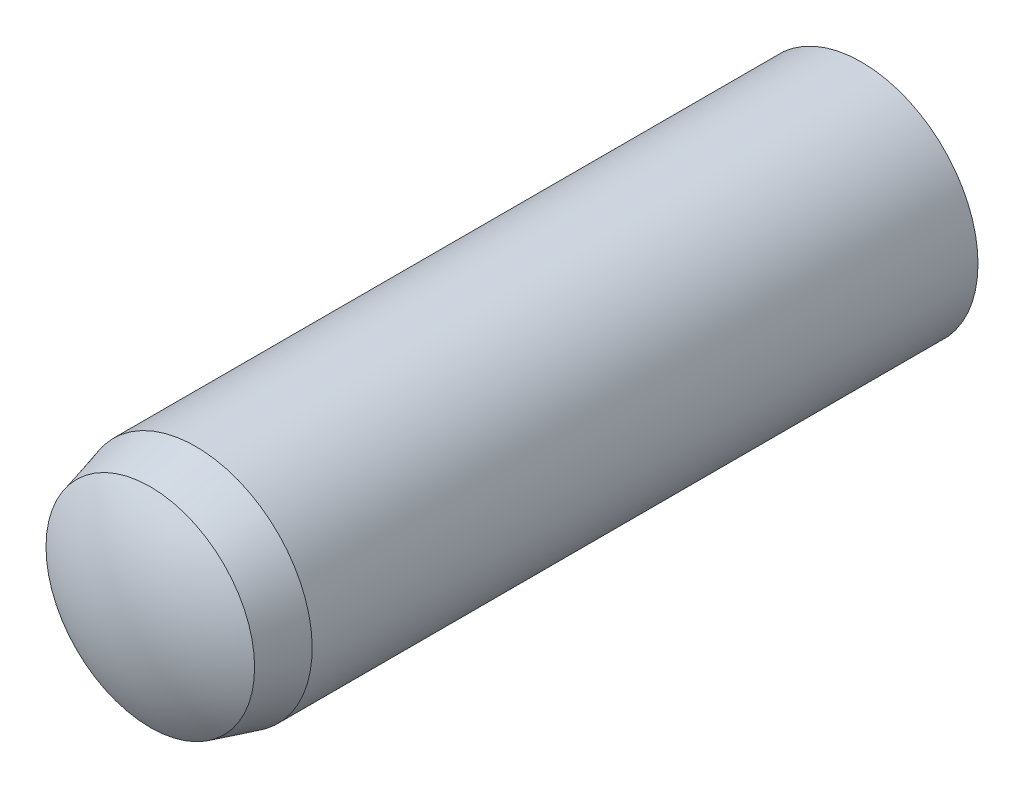
ISO-10303-21;
HEADER;
FILE_DESCRIPTION(('STEP AP214'),'2;1');
FILE_NAME('part.step','',(''),(''),'','','');
FILE_SCHEMA(('AUTOMOTIVE_DESIGN { 1 0 10303 214 1 1 1 1 }'));
ENDSEC;
DATA;
#1=APPLICATION_CONTEXT('core data for automotive mechanical design processes');
#2=APPLICATION_PROTOCOL_DEFINITION('international standard','automotive_design',2000,#1);
#3=PRODUCT_CONTEXT('',#1,'mechanical');
#4=PRODUCT('Part','Part','',(#3));
#5=PRODUCT_RELATED_PRODUCT_CATEGORY('part','',(#4));
#6=PRODUCT_DEFINITION_FORMATION('','',#4);
#7=PRODUCT_DEFINITION_CONTEXT('part definition',#1,'design');
#8=PRODUCT_DEFINITION('design','',#6,#7);
#9=PRODUCT_DEFINITION_SHAPE('','',#8);
#10=(LENGTH_UNIT() NAMED_UNIT(*) SI_UNIT(.MILLI.,.METRE.));
#11=(NAMED_UNIT(*) PLANE_ANGLE_UNIT() SI_UNIT($,.RADIAN.));
#12=(NAMED_UNIT(*) SI_UNIT($,.STERADIAN.) SOLID_ANGLE_UNIT());
#13=UNCERTAINTY_MEASURE_WITH_UNIT(LENGTH_MEASURE(1.E-05),#10,'distance_accuracy_value','');
#14=(GEOMETRIC_REPRESENTATION_CONTEXT(3) GLOBAL_UNCERTAINTY_ASSIGNED_CONTEXT((#13)) GLOBAL_UNIT_ASSIGNED_CONTEXT((#10,
#11,#12)) REPRESENTATION_CONTEXT('',''));
#15=CARTESIAN_POINT('',(0.,0.,0.));
#16=DIRECTION('',(0.,0.,1.));
#17=DIRECTION('',(1.,0.,0.));
#18=AXIS2_PLACEMENT_3D('',#15,#16,#17);
#19=CARTESIAN_POINT('',(0.,0.,-4.54999999999997));
#20=DIRECTION('',(0.,0.,1.));
#21=DIRECTION('',(0.,1.,0.));
#22=AXIS2_PLACEMENT_3D('',#19,#20,#21);
#23=SPHERICAL_SURFACE('',#22,5.45000000000002);
#24=CARTESIAN_POINT('',(0.,0.,-9.1));
#25=DIRECTION('',(0.,0.,1.));
#26=DIRECTION('',(0.,-1.,0.));
#27=AXIS2_PLACEMENT_3D('',#24,#25,#26);
#28=CIRCLE('',#27,3.);
#29=CARTESIAN_POINT('',(0.,-3.,-9.1));
#30=VERTEX_POINT('',#29);
#31=EDGE_CURVE('E10',#30,#30,#28,.T.);
#32=ORIENTED_EDGE('',*,*,#31,.F.);
#33=EDGE_LOOP('',(#32));
#34=FACE_BOUND('',#33,.T.);
#35=ADVANCED_FACE('F35',(#34),#23,.T.);
#36=CARTESIAN_POINT('',(0.,0.,10.));
#37=DIRECTION('',(0.,0.,1.));
#38=DIRECTION('',(0.,-1.,0.));
#39=AXIS2_PLACEMENT_3D('',#36,#37,#38);
#40=CYLINDRICAL_SURFACE('',#39,3.);
#41=CARTESIAN_POINT('',(0.,0.,8.05));
#42=DIRECTION('',(0.,0.,1.));
#43=DIRECTION('',(0.,-1.,0.));
#44=AXIS2_PLACEMENT_3D('',#41,#42,#43);
#45=CIRCLE('',#44,3.);
#46=CARTESIAN_POINT('',(0.,-3.,8.05));
#47=VERTEX_POINT('',#46);
#48=EDGE_CURVE('E41',#47,#47,#45,.T.);
#49=ORIENTED_EDGE('',*,*,#48,.F.);
#50=EDGE_LOOP('',(#49));
#51=FACE_BOUND('',#50,.T.);
#52=ORIENTED_EDGE('',*,*,#31,.T.);
#53=EDGE_LOOP('',(#52));
#54=FACE_BOUND('',#53,.T.);
#55=ADVANCED_FACE('F56',(#51,#54),#40,.T.);
#56=CARTESIAN_POINT('',(0.,0.,8.05));
#57=DIRECTION('',(0.,0.,-1.));
#58=DIRECTION('',(0.,1.,0.));
#59=AXIS2_PLACEMENT_3D('',#56,#57,#58);
#60=CONICAL_SURFACE('',#59,3.,0.261799387799151);
#61=CARTESIAN_POINT('',(0.,0.,9.22));
#62=DIRECTION('',(0.,0.,1.));
#63=DIRECTION('',(0.,-1.,0.));
#64=AXIS2_PLACEMENT_3D('',#61,#62,#63);
#65=CIRCLE('',#64,2.68649944485558);
#66=CARTESIAN_POINT('',(0.,-2.68649944485558,9.22));
#67=VERTEX_POINT('',#66);
#68=EDGE_CURVE('E45',#67,#67,#65,.T.);
#69=ORIENTED_EDGE('',*,*,#68,.F.);
#70=EDGE_LOOP('',(#69));
#71=FACE_BOUND('',#70,.T.);
#72=ORIENTED_EDGE('',*,*,#48,.T.);
#73=EDGE_LOOP('',(#72));
#74=FACE_BOUND('',#73,.T.);
#75=ADVANCED_FACE('F54',(#71,#74),#60,.T.);
#76=CARTESIAN_POINT('',(0.,0.,4.98353893127605));
#77=DIRECTION('',(0.,0.,1.));
#78=DIRECTION('',(0.,1.,0.));
#79=AXIS2_PLACEMENT_3D('',#76,#77,#78);
#80=SPHERICAL_SURFACE('',#79,5.01646106872395);
#81=ORIENTED_EDGE('',*,*,#68,.T.);
#82=EDGE_LOOP('',(#81));
#83=FACE_BOUND('',#82,.T.);
#84=ADVANCED_FACE('F52',(#83),#80,.T.);
#85=CLOSED_SHELL('',(#35,#55,#75,#84));
#86=MANIFOLD_SOLID_BREP('B2',#85);
#87=ADVANCED_BREP_SHAPE_REPRESENTATION('',(#18,#86),#14);
#88=SHAPE_DEFINITION_REPRESENTATION(#9,#87);
ENDSEC;
END-ISO-10303-21;
